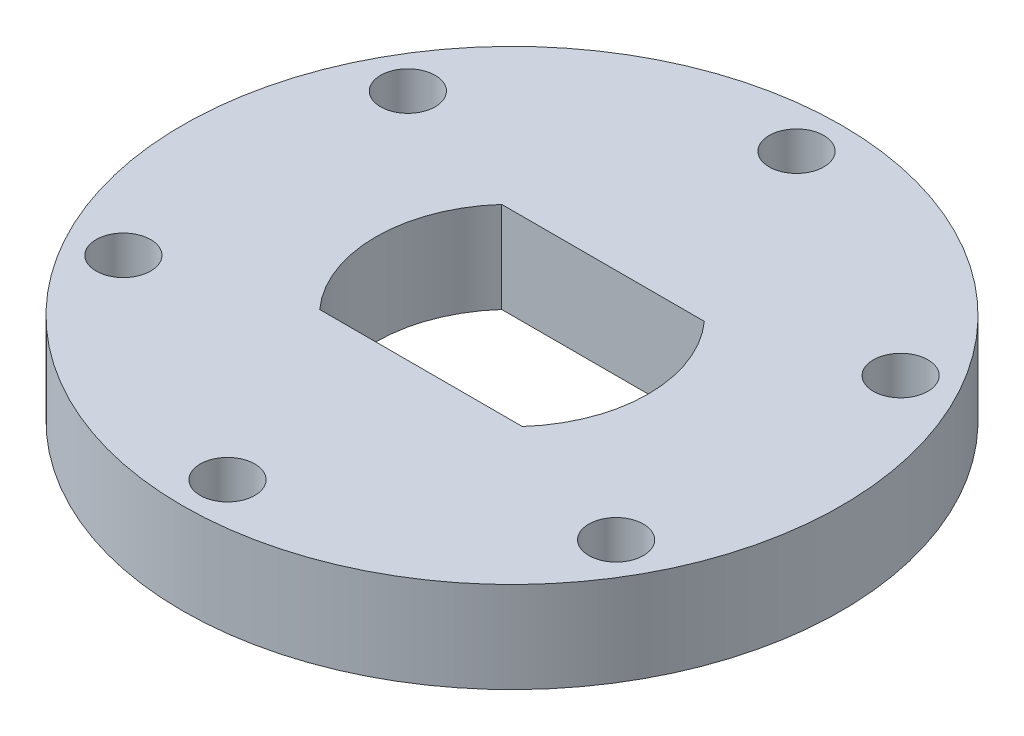
ISO-10303-21;
HEADER;
FILE_DESCRIPTION(('STEP AP214'),'2;1');
FILE_NAME('part.step','',(''),(''),'','','');
FILE_SCHEMA(('AUTOMOTIVE_DESIGN { 1 0 10303 214 1 1 1 1 }'));
ENDSEC;
DATA;
#1=APPLICATION_CONTEXT('core data for automotive mechanical design processes');
#2=APPLICATION_PROTOCOL_DEFINITION('international standard','automotive_design',2000,#1);
#3=PRODUCT_CONTEXT('',#1,'mechanical');
#4=PRODUCT('Part','Part','',(#3));
#5=PRODUCT_RELATED_PRODUCT_CATEGORY('part','',(#4));
#6=PRODUCT_DEFINITION_FORMATION('','',#4);
#7=PRODUCT_DEFINITION_CONTEXT('part definition',#1,'design');
#8=PRODUCT_DEFINITION('design','',#6,#7);
#9=PRODUCT_DEFINITION_SHAPE('','',#8);
#10=(LENGTH_UNIT() NAMED_UNIT(*) SI_UNIT(.MILLI.,.METRE.));
#11=(NAMED_UNIT(*) PLANE_ANGLE_UNIT() SI_UNIT($,.RADIAN.));
#12=(NAMED_UNIT(*) SI_UNIT($,.STERADIAN.) SOLID_ANGLE_UNIT());
#13=UNCERTAINTY_MEASURE_WITH_UNIT(LENGTH_MEASURE(1.E-05),#10,'distance_accuracy_value','');
#14=(GEOMETRIC_REPRESENTATION_CONTEXT(3) GLOBAL_UNCERTAINTY_ASSIGNED_CONTEXT((#13)) GLOBAL_UNIT_ASSIGNED_CONTEXT((#10,
#11,#12)) REPRESENTATION_CONTEXT('',''));
#15=CARTESIAN_POINT('',(0.,0.,0.));
#16=DIRECTION('',(0.,0.,1.));
#17=DIRECTION('',(1.,0.,0.));
#18=AXIS2_PLACEMENT_3D('',#15,#16,#17);
#19=CARTESIAN_POINT('',(0.,6.35,0.));
#20=DIRECTION('',(0.,1.,0.));
#21=DIRECTION('',(0.,0.,1.));
#22=AXIS2_PLACEMENT_3D('',#19,#20,#21);
#23=PLANE('',#22);
#24=CARTESIAN_POINT('',(-17.1851916063475,6.35,9.92187499999984));
#25=DIRECTION('',(0.,1.,0.));
#26=DIRECTION('',(0.,0.,1.));
#27=AXIS2_PLACEMENT_3D('',#24,#25,#26);
#28=CIRCLE('',#27,1.90500000000094);
#29=CARTESIAN_POINT('',(-17.1851916063475,6.35,11.8268750000008));
#30=VERTEX_POINT('',#29);
#31=EDGE_CURVE('E140',#30,#30,#28,.T.);
#32=ORIENTED_EDGE('',*,*,#31,.F.);
#33=EDGE_LOOP('',(#32));
#34=FACE_BOUND('',#33,.T.);
#35=CARTESIAN_POINT('',(17.1851916063475,6.35,9.92187499999982));
#36=DIRECTION('',(0.,1.,0.));
#37=DIRECTION('',(0.,0.,1.));
#38=AXIS2_PLACEMENT_3D('',#35,#36,#37);
#39=CIRCLE('',#38,1.90500000000137);
#40=CARTESIAN_POINT('',(17.1851916063475,6.35,11.8268750000012));
#41=VERTEX_POINT('',#40);
#42=EDGE_CURVE('E143',#41,#41,#39,.T.);
#43=ORIENTED_EDGE('',*,*,#42,.F.);
#44=EDGE_LOOP('',(#43));
#45=FACE_BOUND('',#44,.T.);
#46=DIRECTION('',(1.,0.,0.));
#47=VECTOR('',#46,1.);
#48=CARTESIAN_POINT('',(-7.06593942798833,6.35,6.35));
#49=LINE('',#48,#47);
#50=CARTESIAN_POINT('',(-7.06593942798833,6.35,6.35));
#51=VERTEX_POINT('',#50);
#52=CARTESIAN_POINT('',(7.06593942798833,6.35,6.35));
#53=VERTEX_POINT('',#52);
#54=EDGE_CURVE('E81',#51,#53,#49,.T.);
#55=ORIENTED_EDGE('',*,*,#54,.F.);
#56=CARTESIAN_POINT('',(0.,6.35,0.));
#57=DIRECTION('',(0.,1.,0.));
#58=DIRECTION('',(0.,0.,1.));
#59=AXIS2_PLACEMENT_3D('',#56,#57,#58);
#60=CIRCLE('',#59,9.5);
#61=CARTESIAN_POINT('',(-7.06593942798833,6.35,-6.35));
#62=VERTEX_POINT('',#61);
#63=EDGE_CURVE('E73',#62,#51,#60,.T.);
#64=ORIENTED_EDGE('',*,*,#63,.F.);
#65=DIRECTION('',(-1.,0.,0.));
#66=VECTOR('',#65,1.);
#67=CARTESIAN_POINT('',(-7.06593942798833,6.35,-6.35));
#68=LINE('',#67,#66);
#69=CARTESIAN_POINT('',(7.06593942798833,6.35,-6.35));
#70=VERTEX_POINT('',#69);
#71=EDGE_CURVE('E96',#70,#62,#68,.T.);
#72=ORIENTED_EDGE('',*,*,#71,.F.);
#73=CARTESIAN_POINT('',(0.,6.35,0.));
#74=DIRECTION('',(0.,1.,0.));
#75=DIRECTION('',(0.,0.,1.));
#76=AXIS2_PLACEMENT_3D('',#73,#74,#75);
#77=CIRCLE('',#76,9.5);
#78=EDGE_CURVE('E94',#53,#70,#77,.T.);
#79=ORIENTED_EDGE('',*,*,#78,.F.);
#80=EDGE_LOOP('',(#55,#64,#72,#79));
#81=FACE_BOUND('',#80,.T.);
#82=CARTESIAN_POINT('',(0.,6.35,-19.84375));
#83=DIRECTION('',(0.,1.,0.));
#84=DIRECTION('',(0.,0.,1.));
#85=AXIS2_PLACEMENT_3D('',#82,#83,#84);
#86=CIRCLE('',#85,1.905);
#87=CARTESIAN_POINT('',(0.,6.35,-17.93875));
#88=VERTEX_POINT('',#87);
#89=EDGE_CURVE('E112',#88,#88,#86,.T.);
#90=ORIENTED_EDGE('',*,*,#89,.F.);
#91=EDGE_LOOP('',(#90));
#92=FACE_BOUND('',#91,.T.);
#93=CARTESIAN_POINT('',(0.,6.35,0.));
#94=DIRECTION('',(0.,1.,0.));
#95=DIRECTION('',(0.,0.,1.));
#96=AXIS2_PLACEMENT_3D('',#93,#94,#95);
#97=CIRCLE('',#96,22.987);
#98=CARTESIAN_POINT('',(0.,6.35,22.987));
#99=VERTEX_POINT('',#98);
#100=EDGE_CURVE('E11',#99,#99,#97,.T.);
#101=ORIENTED_EDGE('',*,*,#100,.T.);
#102=EDGE_LOOP('',(#101));
#103=FACE_BOUND('',#102,.T.);
#104=CARTESIAN_POINT('',(17.1851916063478,6.35,-9.92187499999982));
#105=DIRECTION('',(0.,1.,0.));
#106=DIRECTION('',(0.,0.,1.));
#107=AXIS2_PLACEMENT_3D('',#104,#105,#106);
#108=CIRCLE('',#107,1.90500000000036);
#109=CARTESIAN_POINT('',(17.1851916063478,6.35,-8.01687499999946));
#110=VERTEX_POINT('',#109);
#111=EDGE_CURVE('E102',#110,#110,#108,.T.);
#112=ORIENTED_EDGE('',*,*,#111,.F.);
#113=EDGE_LOOP('',(#112));
#114=FACE_BOUND('',#113,.T.);
#115=CARTESIAN_POINT('',(0.,6.35,19.8437499999998));
#116=DIRECTION('',(0.,1.,0.));
#117=DIRECTION('',(0.,0.,1.));
#118=AXIS2_PLACEMENT_3D('',#115,#116,#117);
#119=CIRCLE('',#118,1.90500000000156);
#120=CARTESIAN_POINT('',(0.,6.35,21.7487500000014));
#121=VERTEX_POINT('',#120);
#122=EDGE_CURVE('E150',#121,#121,#119,.T.);
#123=ORIENTED_EDGE('',*,*,#122,.F.);
#124=EDGE_LOOP('',(#123));
#125=FACE_BOUND('',#124,.T.);
#126=CARTESIAN_POINT('',(-17.1851916063478,6.35,-9.9218749999998));
#127=DIRECTION('',(0.,1.,0.));
#128=DIRECTION('',(0.,0.,1.));
#129=AXIS2_PLACEMENT_3D('',#126,#127,#128);
#130=CIRCLE('',#129,1.90500000000054);
#131=CARTESIAN_POINT('',(-17.1851916063478,6.35,-8.01687499999926));
#132=VERTEX_POINT('',#131);
#133=EDGE_CURVE('E168',#132,#132,#130,.T.);
#134=ORIENTED_EDGE('',*,*,#133,.F.);
#135=EDGE_LOOP('',(#134));
#136=FACE_BOUND('',#135,.T.);
#137=ADVANCED_FACE('F32',(#34,#45,#81,#92,#103,#114,#125,#136),#23,.T.);
#138=CARTESIAN_POINT('',(0.,0.,0.));
#139=DIRECTION('',(0.,1.,0.));
#140=DIRECTION('',(0.,0.,1.));
#141=AXIS2_PLACEMENT_3D('',#138,#139,#140);
#142=PLANE('',#141);
#143=CARTESIAN_POINT('',(0.,0.,-19.84375));
#144=DIRECTION('',(0.,1.,0.));
#145=DIRECTION('',(0.,0.,1.));
#146=AXIS2_PLACEMENT_3D('',#143,#144,#145);
#147=CIRCLE('',#146,1.905);
#148=CARTESIAN_POINT('',(0.,0.,-17.93875));
#149=VERTEX_POINT('',#148);
#150=EDGE_CURVE('E89',#149,#149,#147,.T.);
#151=ORIENTED_EDGE('',*,*,#150,.T.);
#152=EDGE_LOOP('',(#151));
#153=FACE_BOUND('',#152,.T.);
#154=CARTESIAN_POINT('',(0.,0.,0.));
#155=DIRECTION('',(0.,1.,0.));
#156=DIRECTION('',(0.,0.,1.));
#157=AXIS2_PLACEMENT_3D('',#154,#155,#156);
#158=CIRCLE('',#157,22.987);
#159=CARTESIAN_POINT('',(0.,0.,22.987));
#160=VERTEX_POINT('',#159);
#161=EDGE_CURVE('E36',#160,#160,#158,.T.);
#162=ORIENTED_EDGE('',*,*,#161,.F.);
#163=EDGE_LOOP('',(#162));
#164=FACE_BOUND('',#163,.T.);
#165=CARTESIAN_POINT('',(0.,0.,0.));
#166=DIRECTION('',(0.,1.,0.));
#167=DIRECTION('',(0.,0.,1.));
#168=AXIS2_PLACEMENT_3D('',#165,#166,#167);
#169=CIRCLE('',#168,9.5);
#170=CARTESIAN_POINT('',(-7.06593942798833,0.,-6.35));
#171=VERTEX_POINT('',#170);
#172=CARTESIAN_POINT('',(-7.06593942798833,0.,6.35));
#173=VERTEX_POINT('',#172);
#174=EDGE_CURVE('E55',#171,#173,#169,.T.);
#175=ORIENTED_EDGE('',*,*,#174,.T.);
#176=DIRECTION('',(1.,0.,0.));
#177=VECTOR('',#176,1.);
#178=CARTESIAN_POINT('',(-7.06593942798833,0.,6.35));
#179=LINE('',#178,#177);
#180=CARTESIAN_POINT('',(7.06593942798833,0.,6.35));
#181=VERTEX_POINT('',#180);
#182=EDGE_CURVE('E88',#173,#181,#179,.T.);
#183=ORIENTED_EDGE('',*,*,#182,.T.);
#184=CARTESIAN_POINT('',(0.,0.,0.));
#185=DIRECTION('',(0.,1.,0.));
#186=DIRECTION('',(0.,0.,1.));
#187=AXIS2_PLACEMENT_3D('',#184,#185,#186);
#188=CIRCLE('',#187,9.5);
#189=CARTESIAN_POINT('',(7.06593942798833,0.,-6.35));
#190=VERTEX_POINT('',#189);
#191=EDGE_CURVE('E104',#181,#190,#188,.T.);
#192=ORIENTED_EDGE('',*,*,#191,.T.);
#193=DIRECTION('',(-1.,0.,0.));
#194=VECTOR('',#193,1.);
#195=CARTESIAN_POINT('',(-7.06593942798833,0.,-6.35));
#196=LINE('',#195,#194);
#197=EDGE_CURVE('E82',#190,#171,#196,.T.);
#198=ORIENTED_EDGE('',*,*,#197,.T.);
#199=EDGE_LOOP('',(#175,#183,#192,#198));
#200=FACE_BOUND('',#199,.T.);
#201=CARTESIAN_POINT('',(17.1851916063478,0.,-9.92187499999982));
#202=DIRECTION('',(0.,1.,0.));
#203=DIRECTION('',(0.,0.,1.));
#204=AXIS2_PLACEMENT_3D('',#201,#202,#203);
#205=CIRCLE('',#204,1.90500000000036);
#206=CARTESIAN_POINT('',(17.1851916063478,0.,-8.01687499999946));
#207=VERTEX_POINT('',#206);
#208=EDGE_CURVE('E145',#207,#207,#205,.T.);
#209=ORIENTED_EDGE('',*,*,#208,.T.);
#210=EDGE_LOOP('',(#209));
#211=FACE_BOUND('',#210,.T.);
#212=CARTESIAN_POINT('',(17.1851916063475,0.,9.92187499999982));
#213=DIRECTION('',(0.,1.,0.));
#214=DIRECTION('',(0.,0.,1.));
#215=AXIS2_PLACEMENT_3D('',#212,#213,#214);
#216=CIRCLE('',#215,1.90500000000137);
#217=CARTESIAN_POINT('',(17.1851916063475,0.,11.8268750000012));
#218=VERTEX_POINT('',#217);
#219=EDGE_CURVE('E146',#218,#218,#216,.T.);
#220=ORIENTED_EDGE('',*,*,#219,.T.);
#221=EDGE_LOOP('',(#220));
#222=FACE_BOUND('',#221,.T.);
#223=CARTESIAN_POINT('',(0.,0.,19.8437499999998));
#224=DIRECTION('',(0.,1.,0.));
#225=DIRECTION('',(0.,0.,1.));
#226=AXIS2_PLACEMENT_3D('',#223,#224,#225);
#227=CIRCLE('',#226,1.90500000000156);
#228=CARTESIAN_POINT('',(0.,0.,21.7487500000014));
#229=VERTEX_POINT('',#228);
#230=EDGE_CURVE('E153',#229,#229,#227,.T.);
#231=ORIENTED_EDGE('',*,*,#230,.T.);
#232=EDGE_LOOP('',(#231));
#233=FACE_BOUND('',#232,.T.);
#234=CARTESIAN_POINT('',(-17.1851916063475,0.,9.92187499999984));
#235=DIRECTION('',(0.,1.,0.));
#236=DIRECTION('',(0.,0.,1.));
#237=AXIS2_PLACEMENT_3D('',#234,#235,#236);
#238=CIRCLE('',#237,1.90500000000094);
#239=CARTESIAN_POINT('',(-17.1851916063475,0.,11.8268750000008));
#240=VERTEX_POINT('',#239);
#241=EDGE_CURVE('E170',#240,#240,#238,.T.);
#242=ORIENTED_EDGE('',*,*,#241,.T.);
#243=EDGE_LOOP('',(#242));
#244=FACE_BOUND('',#243,.T.);
#245=CARTESIAN_POINT('',(-17.1851916063478,0.,-9.9218749999998));
#246=DIRECTION('',(0.,1.,0.));
#247=DIRECTION('',(0.,0.,1.));
#248=AXIS2_PLACEMENT_3D('',#245,#246,#247);
#249=CIRCLE('',#248,1.90500000000054);
#250=CARTESIAN_POINT('',(-17.1851916063478,0.,-8.01687499999926));
#251=VERTEX_POINT('',#250);
#252=EDGE_CURVE('E171',#251,#251,#249,.T.);
#253=ORIENTED_EDGE('',*,*,#252,.T.);
#254=EDGE_LOOP('',(#253));
#255=FACE_BOUND('',#254,.T.);
#256=ADVANCED_FACE('F118',(#153,#164,#200,#211,#222,#233,#244,#255),#142,.F.);
#257=CARTESIAN_POINT('',(0.,6.35,0.));
#258=DIRECTION('',(0.,-1.,0.));
#259=DIRECTION('',(0.,0.,-1.));
#260=AXIS2_PLACEMENT_3D('',#257,#258,#259);
#261=CYLINDRICAL_SURFACE('',#260,22.987);
#262=ORIENTED_EDGE('',*,*,#100,.F.);
#263=EDGE_LOOP('',(#262));
#264=FACE_BOUND('',#263,.T.);
#265=ORIENTED_EDGE('',*,*,#161,.T.);
#266=EDGE_LOOP('',(#265));
#267=FACE_BOUND('',#266,.T.);
#268=ADVANCED_FACE('F34',(#264,#267),#261,.T.);
#269=CARTESIAN_POINT('',(0.,6.35,-19.84375));
#270=DIRECTION('',(0.,-1.,0.));
#271=DIRECTION('',(0.,0.,-1.));
#272=AXIS2_PLACEMENT_3D('',#269,#270,#271);
#273=CYLINDRICAL_SURFACE('',#272,1.905);
#274=ORIENTED_EDGE('',*,*,#89,.T.);
#275=EDGE_LOOP('',(#274));
#276=FACE_BOUND('',#275,.T.);
#277=ORIENTED_EDGE('',*,*,#150,.F.);
#278=EDGE_LOOP('',(#277));
#279=FACE_BOUND('',#278,.T.);
#280=ADVANCED_FACE('F121',(#276,#279),#273,.F.);
#281=CARTESIAN_POINT('',(0.,6.35,0.));
#282=DIRECTION('',(0.,-1.,0.));
#283=DIRECTION('',(0.,0.,-1.));
#284=AXIS2_PLACEMENT_3D('',#281,#282,#283);
#285=CYLINDRICAL_SURFACE('',#284,9.5);
#286=ORIENTED_EDGE('',*,*,#174,.F.);
#287=DIRECTION('',(0.,-1.,0.));
#288=VECTOR('',#287,1.);
#289=CARTESIAN_POINT('',(-7.06593942798833,6.35,-6.35));
#290=LINE('',#289,#288);
#291=EDGE_CURVE('E77',#62,#171,#290,.T.);
#292=ORIENTED_EDGE('',*,*,#291,.F.);
#293=ORIENTED_EDGE('',*,*,#63,.T.);
#294=DIRECTION('',(0.,-1.,0.));
#295=VECTOR('',#294,1.);
#296=CARTESIAN_POINT('',(-7.06593942798833,6.35,6.35));
#297=LINE('',#296,#295);
#298=EDGE_CURVE('E76',#51,#173,#297,.T.);
#299=ORIENTED_EDGE('',*,*,#298,.T.);
#300=EDGE_LOOP('',(#286,#292,#293,#299));
#301=FACE_BOUND('',#300,.T.);
#302=ADVANCED_FACE('F75',(#301),#285,.F.);
#303=CARTESIAN_POINT('',(-7.06593942798833,6.35,6.35));
#304=DIRECTION('',(0.,0.,-1.));
#305=DIRECTION('',(-1.,0.,0.));
#306=AXIS2_PLACEMENT_3D('',#303,#304,#305);
#307=PLANE('',#306);
#308=ORIENTED_EDGE('',*,*,#182,.F.);
#309=ORIENTED_EDGE('',*,*,#298,.F.);
#310=ORIENTED_EDGE('',*,*,#54,.T.);
#311=DIRECTION('',(0.,-1.,0.));
#312=VECTOR('',#311,1.);
#313=CARTESIAN_POINT('',(7.06593942798833,6.35,6.35));
#314=LINE('',#313,#312);
#315=EDGE_CURVE('E90',#53,#181,#314,.T.);
#316=ORIENTED_EDGE('',*,*,#315,.T.);
#317=EDGE_LOOP('',(#308,#309,#310,#316));
#318=FACE_BOUND('',#317,.T.);
#319=ADVANCED_FACE('F85',(#318),#307,.T.);
#320=CARTESIAN_POINT('',(0.,6.35,0.));
#321=DIRECTION('',(0.,-1.,0.));
#322=DIRECTION('',(0.,0.,-1.));
#323=AXIS2_PLACEMENT_3D('',#320,#321,#322);
#324=CYLINDRICAL_SURFACE('',#323,9.5);
#325=ORIENTED_EDGE('',*,*,#191,.F.);
#326=ORIENTED_EDGE('',*,*,#315,.F.);
#327=ORIENTED_EDGE('',*,*,#78,.T.);
#328=DIRECTION('',(0.,-1.,0.));
#329=VECTOR('',#328,1.);
#330=CARTESIAN_POINT('',(7.06593942798833,6.35,-6.35));
#331=LINE('',#330,#329);
#332=EDGE_CURVE('E47',#70,#190,#331,.T.);
#333=ORIENTED_EDGE('',*,*,#332,.T.);
#334=EDGE_LOOP('',(#325,#326,#327,#333));
#335=FACE_BOUND('',#334,.T.);
#336=ADVANCED_FACE('F204',(#335),#324,.F.);
#337=CARTESIAN_POINT('',(-7.06593942798833,6.35,-6.35));
#338=DIRECTION('',(0.,0.,1.));
#339=DIRECTION('',(1.,0.,0.));
#340=AXIS2_PLACEMENT_3D('',#337,#338,#339);
#341=PLANE('',#340);
#342=ORIENTED_EDGE('',*,*,#197,.F.);
#343=ORIENTED_EDGE('',*,*,#332,.F.);
#344=ORIENTED_EDGE('',*,*,#71,.T.);
#345=ORIENTED_EDGE('',*,*,#291,.T.);
#346=EDGE_LOOP('',(#342,#343,#344,#345));
#347=FACE_BOUND('',#346,.T.);
#348=ADVANCED_FACE('F201',(#347),#341,.T.);
#349=CARTESIAN_POINT('',(17.1851916063478,6.35,-9.92187499999982));
#350=DIRECTION('',(0.,-1.,0.));
#351=DIRECTION('',(0.,0.,-1.));
#352=AXIS2_PLACEMENT_3D('',#349,#350,#351);
#353=CYLINDRICAL_SURFACE('',#352,1.90500000000036);
#354=ORIENTED_EDGE('',*,*,#111,.T.);
#355=EDGE_LOOP('',(#354));
#356=FACE_BOUND('',#355,.T.);
#357=ORIENTED_EDGE('',*,*,#208,.F.);
#358=EDGE_LOOP('',(#357));
#359=FACE_BOUND('',#358,.T.);
#360=ADVANCED_FACE('F159',(#356,#359),#353,.F.);
#361=CARTESIAN_POINT('',(17.1851916063475,6.35,9.92187499999982));
#362=DIRECTION('',(0.,-1.,0.));
#363=DIRECTION('',(0.,0.,-1.));
#364=AXIS2_PLACEMENT_3D('',#361,#362,#363);
#365=CYLINDRICAL_SURFACE('',#364,1.90500000000137);
#366=ORIENTED_EDGE('',*,*,#42,.T.);
#367=EDGE_LOOP('',(#366));
#368=FACE_BOUND('',#367,.T.);
#369=ORIENTED_EDGE('',*,*,#219,.F.);
#370=EDGE_LOOP('',(#369));
#371=FACE_BOUND('',#370,.T.);
#372=ADVANCED_FACE('F187',(#368,#371),#365,.F.);
#373=CARTESIAN_POINT('',(0.,6.35,19.8437499999998));
#374=DIRECTION('',(0.,-1.,0.));
#375=DIRECTION('',(0.,0.,-1.));
#376=AXIS2_PLACEMENT_3D('',#373,#374,#375);
#377=CYLINDRICAL_SURFACE('',#376,1.90500000000156);
#378=ORIENTED_EDGE('',*,*,#122,.T.);
#379=EDGE_LOOP('',(#378));
#380=FACE_BOUND('',#379,.T.);
#381=ORIENTED_EDGE('',*,*,#230,.F.);
#382=EDGE_LOOP('',(#381));
#383=FACE_BOUND('',#382,.T.);
#384=ADVANCED_FACE('F184',(#380,#383),#377,.F.);
#385=CARTESIAN_POINT('',(-17.1851916063475,6.35,9.92187499999984));
#386=DIRECTION('',(0.,-1.,0.));
#387=DIRECTION('',(0.,0.,-1.));
#388=AXIS2_PLACEMENT_3D('',#385,#386,#387);
#389=CYLINDRICAL_SURFACE('',#388,1.90500000000094);
#390=ORIENTED_EDGE('',*,*,#31,.T.);
#391=EDGE_LOOP('',(#390));
#392=FACE_BOUND('',#391,.T.);
#393=ORIENTED_EDGE('',*,*,#241,.F.);
#394=EDGE_LOOP('',(#393));
#395=FACE_BOUND('',#394,.T.);
#396=ADVANCED_FACE('F186',(#392,#395),#389,.F.);
#397=CARTESIAN_POINT('',(-17.1851916063478,6.35,-9.9218749999998));
#398=DIRECTION('',(0.,-1.,0.));
#399=DIRECTION('',(0.,0.,-1.));
#400=AXIS2_PLACEMENT_3D('',#397,#398,#399);
#401=CYLINDRICAL_SURFACE('',#400,1.90500000000054);
#402=ORIENTED_EDGE('',*,*,#133,.T.);
#403=EDGE_LOOP('',(#402));
#404=FACE_BOUND('',#403,.T.);
#405=ORIENTED_EDGE('',*,*,#252,.F.);
#406=EDGE_LOOP('',(#405));
#407=FACE_BOUND('',#406,.T.);
#408=ADVANCED_FACE('F193',(#404,#407),#401,.F.);
#409=CLOSED_SHELL('',(#137,#256,#268,#280,#302,#319,#336,#348,#360,#372,#384,#396,#408));
#410=MANIFOLD_SOLID_BREP('B2',#409);
#411=ADVANCED_BREP_SHAPE_REPRESENTATION('',(#18,#410),#14);
#412=SHAPE_DEFINITION_REPRESENTATION(#9,#411);
ENDSEC;
END-ISO-10303-21;
